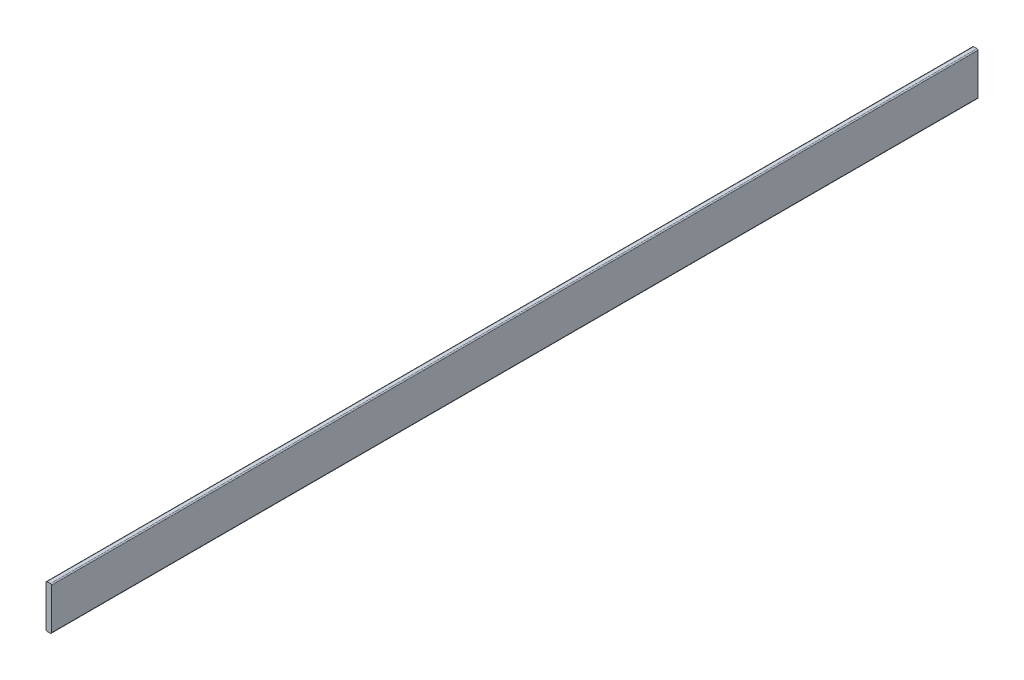
ISO-10303-21;
HEADER;
FILE_DESCRIPTION(('STEP AP214'),'2;1');
FILE_NAME('part.step','',(''),(''),'','','');
FILE_SCHEMA(('AUTOMOTIVE_DESIGN { 1 0 10303 214 1 1 1 1 }'));
ENDSEC;
DATA;
#1=APPLICATION_CONTEXT('core data for automotive mechanical design processes');
#2=APPLICATION_PROTOCOL_DEFINITION('international standard','automotive_design',2000,#1);
#3=PRODUCT_CONTEXT('',#1,'mechanical');
#4=PRODUCT('Part','Part','',(#3));
#5=PRODUCT_RELATED_PRODUCT_CATEGORY('part','',(#4));
#6=PRODUCT_DEFINITION_FORMATION('','',#4);
#7=PRODUCT_DEFINITION_CONTEXT('part definition',#1,'design');
#8=PRODUCT_DEFINITION('design','',#6,#7);
#9=PRODUCT_DEFINITION_SHAPE('','',#8);
#10=(LENGTH_UNIT() NAMED_UNIT(*) SI_UNIT(.MILLI.,.METRE.));
#11=(NAMED_UNIT(*) PLANE_ANGLE_UNIT() SI_UNIT($,.RADIAN.));
#12=(NAMED_UNIT(*) SI_UNIT($,.STERADIAN.) SOLID_ANGLE_UNIT());
#13=UNCERTAINTY_MEASURE_WITH_UNIT(LENGTH_MEASURE(1.E-05),#10,'distance_accuracy_value','');
#14=(GEOMETRIC_REPRESENTATION_CONTEXT(3) GLOBAL_UNCERTAINTY_ASSIGNED_CONTEXT((#13)) GLOBAL_UNIT_ASSIGNED_CONTEXT((#10,
#11,#12)) REPRESENTATION_CONTEXT('',''));
#15=CARTESIAN_POINT('',(0.,0.,0.));
#16=DIRECTION('',(0.,0.,1.));
#17=DIRECTION('',(1.,0.,0.));
#18=AXIS2_PLACEMENT_3D('',#15,#16,#17);
#19=CARTESIAN_POINT('',(2.54,0.635,546.1));
#20=DIRECTION('',(0.,0.,-1.));
#21=DIRECTION('',(-1.,0.,0.));
#22=AXIS2_PLACEMENT_3D('',#19,#20,#21);
#23=CYLINDRICAL_SURFACE('',#22,0.635);
#24=CARTESIAN_POINT('',(2.54,0.635,0.));
#25=DIRECTION('',(0.,0.,1.));
#26=DIRECTION('',(1.,0.,0.));
#27=AXIS2_PLACEMENT_3D('',#24,#25,#26);
#28=CIRCLE('',#27,0.635);
#29=CARTESIAN_POINT('',(2.54,0.,0.));
#30=VERTEX_POINT('',#29);
#31=CARTESIAN_POINT('',(3.175,0.635000000000005,0.));
#32=VERTEX_POINT('',#31);
#33=EDGE_CURVE('E128',#30,#32,#28,.T.);
#34=ORIENTED_EDGE('',*,*,#33,.T.);
#35=DIRECTION('',(0.,0.,-1.));
#36=VECTOR('',#35,1.);
#37=CARTESIAN_POINT('',(3.175,0.635000000000005,546.1));
#38=LINE('',#37,#36);
#39=CARTESIAN_POINT('',(3.175,0.635000000000005,546.1));
#40=VERTEX_POINT('',#39);
#41=EDGE_CURVE('E11',#40,#32,#38,.T.);
#42=ORIENTED_EDGE('',*,*,#41,.F.);
#43=CARTESIAN_POINT('',(2.54,0.635,546.1));
#44=DIRECTION('',(0.,0.,1.));
#45=DIRECTION('',(1.,0.,0.));
#46=AXIS2_PLACEMENT_3D('',#43,#44,#45);
#47=CIRCLE('',#46,0.635);
#48=CARTESIAN_POINT('',(2.54,0.,546.1));
#49=VERTEX_POINT('',#48);
#50=EDGE_CURVE('E142',#49,#40,#47,.T.);
#51=ORIENTED_EDGE('',*,*,#50,.F.);
#52=DIRECTION('',(0.,0.,-1.));
#53=VECTOR('',#52,1.);
#54=CARTESIAN_POINT('',(2.54,0.,546.1));
#55=LINE('',#54,#53);
#56=EDGE_CURVE('E124',#49,#30,#55,.T.);
#57=ORIENTED_EDGE('',*,*,#56,.T.);
#58=EDGE_LOOP('',(#34,#42,#51,#57));
#59=FACE_BOUND('',#58,.T.);
#60=ADVANCED_FACE('F32',(#59),#23,.T.);
#61=CARTESIAN_POINT('',(3.175,0.635000000000005,546.1));
#62=DIRECTION('',(-1.,0.,0.));
#63=DIRECTION('',(0.,0.,1.));
#64=AXIS2_PLACEMENT_3D('',#61,#62,#63);
#65=PLANE('',#64);
#66=DIRECTION('',(0.,1.,0.));
#67=VECTOR('',#66,1.);
#68=CARTESIAN_POINT('',(3.175,0.635000000000005,0.));
#69=LINE('',#68,#67);
#70=CARTESIAN_POINT('',(3.175,24.765,0.));
#71=VERTEX_POINT('',#70);
#72=EDGE_CURVE('E131',#32,#71,#69,.T.);
#73=ORIENTED_EDGE('',*,*,#72,.T.);
#74=DIRECTION('',(0.,0.,-1.));
#75=VECTOR('',#74,1.);
#76=CARTESIAN_POINT('',(3.175,24.765,546.1));
#77=LINE('',#76,#75);
#78=CARTESIAN_POINT('',(3.175,24.765,546.1));
#79=VERTEX_POINT('',#78);
#80=EDGE_CURVE('E40',#79,#71,#77,.T.);
#81=ORIENTED_EDGE('',*,*,#80,.F.);
#82=DIRECTION('',(0.,1.,0.));
#83=VECTOR('',#82,1.);
#84=CARTESIAN_POINT('',(3.175,0.635000000000005,546.1));
#85=LINE('',#84,#83);
#86=EDGE_CURVE('E91',#40,#79,#85,.T.);
#87=ORIENTED_EDGE('',*,*,#86,.F.);
#88=ORIENTED_EDGE('',*,*,#41,.T.);
#89=EDGE_LOOP('',(#73,#81,#87,#88));
#90=FACE_BOUND('',#89,.T.);
#91=ADVANCED_FACE('F177',(#90),#65,.F.);
#92=CARTESIAN_POINT('',(2.54,24.765,546.1));
#93=DIRECTION('',(0.,0.,-1.));
#94=DIRECTION('',(-1.,0.,0.));
#95=AXIS2_PLACEMENT_3D('',#92,#93,#94);
#96=CYLINDRICAL_SURFACE('',#95,0.635);
#97=CARTESIAN_POINT('',(2.54,24.765,0.));
#98=DIRECTION('',(0.,0.,1.));
#99=DIRECTION('',(-1.,0.,0.));
#100=AXIS2_PLACEMENT_3D('',#97,#98,#99);
#101=CIRCLE('',#100,0.635);
#102=CARTESIAN_POINT('',(2.54,25.4,0.));
#103=VERTEX_POINT('',#102);
#104=EDGE_CURVE('E133',#71,#103,#101,.T.);
#105=ORIENTED_EDGE('',*,*,#104,.T.);
#106=DIRECTION('',(0.,0.,-1.));
#107=VECTOR('',#106,1.);
#108=CARTESIAN_POINT('',(2.54,25.4,546.1));
#109=LINE('',#108,#107);
#110=CARTESIAN_POINT('',(2.54,25.4,546.1));
#111=VERTEX_POINT('',#110);
#112=EDGE_CURVE('E149',#111,#103,#109,.T.);
#113=ORIENTED_EDGE('',*,*,#112,.F.);
#114=CARTESIAN_POINT('',(2.54,24.765,546.1));
#115=DIRECTION('',(0.,0.,1.));
#116=DIRECTION('',(-1.,0.,0.));
#117=AXIS2_PLACEMENT_3D('',#114,#115,#116);
#118=CIRCLE('',#117,0.635);
#119=EDGE_CURVE('E157',#79,#111,#118,.T.);
#120=ORIENTED_EDGE('',*,*,#119,.F.);
#121=ORIENTED_EDGE('',*,*,#80,.T.);
#122=EDGE_LOOP('',(#105,#113,#120,#121));
#123=FACE_BOUND('',#122,.T.);
#124=ADVANCED_FACE('F155',(#123),#96,.T.);
#125=CARTESIAN_POINT('',(0.635000000000005,25.4,546.1));
#126=DIRECTION('',(0.,-1.,0.));
#127=DIRECTION('',(0.,0.,-1.));
#128=AXIS2_PLACEMENT_3D('',#125,#126,#127);
#129=PLANE('',#128);
#130=DIRECTION('',(-1.,0.,0.));
#131=VECTOR('',#130,1.);
#132=CARTESIAN_POINT('',(0.635000000000005,25.4,0.));
#133=LINE('',#132,#131);
#134=CARTESIAN_POINT('',(0.635000000000005,25.4,0.));
#135=VERTEX_POINT('',#134);
#136=EDGE_CURVE('E135',#103,#135,#133,.T.);
#137=ORIENTED_EDGE('',*,*,#136,.T.);
#138=DIRECTION('',(0.,0.,-1.));
#139=VECTOR('',#138,1.);
#140=CARTESIAN_POINT('',(0.635000000000005,25.4,546.1));
#141=LINE('',#140,#139);
#142=CARTESIAN_POINT('',(0.635000000000005,25.4,546.1));
#143=VERTEX_POINT('',#142);
#144=EDGE_CURVE('E146',#143,#135,#141,.T.);
#145=ORIENTED_EDGE('',*,*,#144,.F.);
#146=DIRECTION('',(-1.,0.,0.));
#147=VECTOR('',#146,1.);
#148=CARTESIAN_POINT('',(0.635000000000005,25.4,546.1));
#149=LINE('',#148,#147);
#150=EDGE_CURVE('E169',#111,#143,#149,.T.);
#151=ORIENTED_EDGE('',*,*,#150,.F.);
#152=ORIENTED_EDGE('',*,*,#112,.T.);
#153=EDGE_LOOP('',(#137,#145,#151,#152));
#154=FACE_BOUND('',#153,.T.);
#155=ADVANCED_FACE('F165',(#154),#129,.F.);
#156=CARTESIAN_POINT('',(0.635,24.765,546.1));
#157=DIRECTION('',(0.,0.,-1.));
#158=DIRECTION('',(-1.,0.,0.));
#159=AXIS2_PLACEMENT_3D('',#156,#157,#158);
#160=CYLINDRICAL_SURFACE('',#159,0.635);
#161=CARTESIAN_POINT('',(0.635,24.765,0.));
#162=DIRECTION('',(0.,0.,1.));
#163=DIRECTION('',(-1.,0.,0.));
#164=AXIS2_PLACEMENT_3D('',#161,#162,#163);
#165=CIRCLE('',#164,0.635);
#166=CARTESIAN_POINT('',(0.,24.765,0.));
#167=VERTEX_POINT('',#166);
#168=EDGE_CURVE('E137',#135,#167,#165,.T.);
#169=ORIENTED_EDGE('',*,*,#168,.T.);
#170=DIRECTION('',(0.,0.,-1.));
#171=VECTOR('',#170,1.);
#172=CARTESIAN_POINT('',(0.,24.765,546.1));
#173=LINE('',#172,#171);
#174=CARTESIAN_POINT('',(0.,24.765,546.1));
#175=VERTEX_POINT('',#174);
#176=EDGE_CURVE('E119',#175,#167,#173,.T.);
#177=ORIENTED_EDGE('',*,*,#176,.F.);
#178=CARTESIAN_POINT('',(0.635,24.765,546.1));
#179=DIRECTION('',(0.,0.,1.));
#180=DIRECTION('',(-1.,0.,0.));
#181=AXIS2_PLACEMENT_3D('',#178,#179,#180);
#182=CIRCLE('',#181,0.635);
#183=EDGE_CURVE('E110',#143,#175,#182,.T.);
#184=ORIENTED_EDGE('',*,*,#183,.F.);
#185=ORIENTED_EDGE('',*,*,#144,.T.);
#186=EDGE_LOOP('',(#169,#177,#184,#185));
#187=FACE_BOUND('',#186,.T.);
#188=ADVANCED_FACE('F168',(#187),#160,.T.);
#189=CARTESIAN_POINT('',(0.,0.635000000000005,546.1));
#190=DIRECTION('',(1.,0.,0.));
#191=DIRECTION('',(0.,0.,-1.));
#192=AXIS2_PLACEMENT_3D('',#189,#190,#191);
#193=PLANE('',#192);
#194=DIRECTION('',(0.,-1.,0.));
#195=VECTOR('',#194,1.);
#196=CARTESIAN_POINT('',(0.,0.635000000000005,0.));
#197=LINE('',#196,#195);
#198=CARTESIAN_POINT('',(0.,0.635000000000005,0.));
#199=VERTEX_POINT('',#198);
#200=EDGE_CURVE('E118',#167,#199,#197,.T.);
#201=ORIENTED_EDGE('',*,*,#200,.T.);
#202=DIRECTION('',(0.,0.,-1.));
#203=VECTOR('',#202,1.);
#204=CARTESIAN_POINT('',(0.,0.635000000000005,546.1));
#205=LINE('',#204,#203);
#206=CARTESIAN_POINT('',(0.,0.635000000000005,546.1));
#207=VERTEX_POINT('',#206);
#208=EDGE_CURVE('E115',#207,#199,#205,.T.);
#209=ORIENTED_EDGE('',*,*,#208,.F.);
#210=DIRECTION('',(0.,-1.,0.));
#211=VECTOR('',#210,1.);
#212=CARTESIAN_POINT('',(0.,0.635000000000005,546.1));
#213=LINE('',#212,#211);
#214=EDGE_CURVE('E104',#175,#207,#213,.T.);
#215=ORIENTED_EDGE('',*,*,#214,.F.);
#216=ORIENTED_EDGE('',*,*,#176,.T.);
#217=EDGE_LOOP('',(#201,#209,#215,#216));
#218=FACE_BOUND('',#217,.T.);
#219=ADVANCED_FACE('F116',(#218),#193,.F.);
#220=CARTESIAN_POINT('',(0.635,0.635,546.1));
#221=DIRECTION('',(0.,0.,-1.));
#222=DIRECTION('',(-1.,0.,0.));
#223=AXIS2_PLACEMENT_3D('',#220,#221,#222);
#224=CYLINDRICAL_SURFACE('',#223,0.635);
#225=CARTESIAN_POINT('',(0.635,0.635,0.));
#226=DIRECTION('',(0.,0.,1.));
#227=DIRECTION('',(-1.,0.,0.));
#228=AXIS2_PLACEMENT_3D('',#225,#226,#227);
#229=CIRCLE('',#228,0.635);
#230=CARTESIAN_POINT('',(0.635000000000005,0.,0.));
#231=VERTEX_POINT('',#230);
#232=EDGE_CURVE('E77',#199,#231,#229,.T.);
#233=ORIENTED_EDGE('',*,*,#232,.T.);
#234=DIRECTION('',(0.,0.,-1.));
#235=VECTOR('',#234,1.);
#236=CARTESIAN_POINT('',(0.635000000000005,0.,546.1));
#237=LINE('',#236,#235);
#238=CARTESIAN_POINT('',(0.635000000000005,0.,546.1));
#239=VERTEX_POINT('',#238);
#240=EDGE_CURVE('E120',#239,#231,#237,.T.);
#241=ORIENTED_EDGE('',*,*,#240,.F.);
#242=CARTESIAN_POINT('',(0.635,0.635,546.1));
#243=DIRECTION('',(0.,0.,1.));
#244=DIRECTION('',(-1.,0.,0.));
#245=AXIS2_PLACEMENT_3D('',#242,#243,#244);
#246=CIRCLE('',#245,0.635);
#247=EDGE_CURVE('E108',#207,#239,#246,.T.);
#248=ORIENTED_EDGE('',*,*,#247,.F.);
#249=ORIENTED_EDGE('',*,*,#208,.T.);
#250=EDGE_LOOP('',(#233,#241,#248,#249));
#251=FACE_BOUND('',#250,.T.);
#252=ADVANCED_FACE('F122',(#251),#224,.T.);
#253=CARTESIAN_POINT('',(0.635000000000005,0.,546.1));
#254=DIRECTION('',(0.,1.,0.));
#255=DIRECTION('',(0.,0.,1.));
#256=AXIS2_PLACEMENT_3D('',#253,#254,#255);
#257=PLANE('',#256);
#258=DIRECTION('',(1.,0.,0.));
#259=VECTOR('',#258,1.);
#260=CARTESIAN_POINT('',(0.635000000000005,0.,0.));
#261=LINE('',#260,#259);
#262=EDGE_CURVE('E83',#231,#30,#261,.T.);
#263=ORIENTED_EDGE('',*,*,#262,.T.);
#264=ORIENTED_EDGE('',*,*,#56,.F.);
#265=DIRECTION('',(1.,0.,0.));
#266=VECTOR('',#265,1.);
#267=CARTESIAN_POINT('',(0.635000000000005,0.,546.1));
#268=LINE('',#267,#266);
#269=EDGE_CURVE('E48',#239,#49,#268,.T.);
#270=ORIENTED_EDGE('',*,*,#269,.F.);
#271=ORIENTED_EDGE('',*,*,#240,.T.);
#272=EDGE_LOOP('',(#263,#264,#270,#271));
#273=FACE_BOUND('',#272,.T.);
#274=ADVANCED_FACE('F193',(#273),#257,.F.);
#275=CARTESIAN_POINT('',(2.54,0.635,546.1));
#276=DIRECTION('',(0.,0.,1.));
#277=DIRECTION('',(1.,0.,0.));
#278=AXIS2_PLACEMENT_3D('',#275,#276,#277);
#279=PLANE('',#278);
#280=ORIENTED_EDGE('',*,*,#50,.T.);
#281=ORIENTED_EDGE('',*,*,#86,.T.);
#282=ORIENTED_EDGE('',*,*,#119,.T.);
#283=ORIENTED_EDGE('',*,*,#150,.T.);
#284=ORIENTED_EDGE('',*,*,#183,.T.);
#285=ORIENTED_EDGE('',*,*,#214,.T.);
#286=ORIENTED_EDGE('',*,*,#247,.T.);
#287=ORIENTED_EDGE('',*,*,#269,.T.);
#288=EDGE_LOOP('',(#280,#281,#282,#283,#284,#285,#286,#287));
#289=FACE_BOUND('',#288,.T.);
#290=ADVANCED_FACE('F106',(#289),#279,.T.);
#291=CARTESIAN_POINT('',(2.54,0.635,0.));
#292=DIRECTION('',(0.,0.,1.));
#293=DIRECTION('',(1.,0.,0.));
#294=AXIS2_PLACEMENT_3D('',#291,#292,#293);
#295=PLANE('',#294);
#296=ORIENTED_EDGE('',*,*,#33,.F.);
#297=ORIENTED_EDGE('',*,*,#262,.F.);
#298=ORIENTED_EDGE('',*,*,#232,.F.);
#299=ORIENTED_EDGE('',*,*,#200,.F.);
#300=ORIENTED_EDGE('',*,*,#168,.F.);
#301=ORIENTED_EDGE('',*,*,#136,.F.);
#302=ORIENTED_EDGE('',*,*,#104,.F.);
#303=ORIENTED_EDGE('',*,*,#72,.F.);
#304=EDGE_LOOP('',(#296,#297,#298,#299,#300,#301,#302,#303));
#305=FACE_BOUND('',#304,.T.);
#306=ADVANCED_FACE('F161',(#305),#295,.F.);
#307=CLOSED_SHELL('',(#60,#91,#124,#155,#188,#219,#252,#274,#290,#306));
#308=MANIFOLD_SOLID_BREP('B2',#307);
#309=ADVANCED_BREP_SHAPE_REPRESENTATION('',(#18,#308),#14);
#310=SHAPE_DEFINITION_REPRESENTATION(#9,#309);
ENDSEC;
END-ISO-10303-21;
